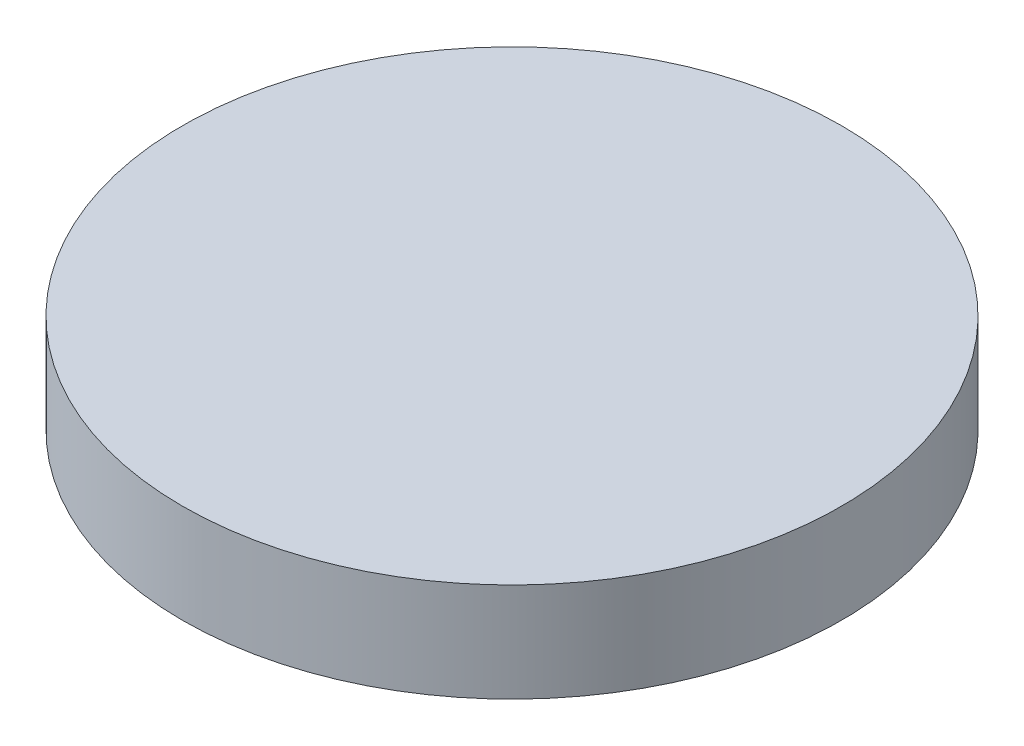
ISO-10303-21;
HEADER;
FILE_DESCRIPTION(('STEP AP214'),'2;1');
FILE_NAME('part.step','',(''),(''),'','','');
FILE_SCHEMA(('AUTOMOTIVE_DESIGN { 1 0 10303 214 1 1 1 1 }'));
ENDSEC;
DATA;
#1=APPLICATION_CONTEXT('core data for automotive mechanical design processes');
#2=APPLICATION_PROTOCOL_DEFINITION('international standard','automotive_design',2000,#1);
#3=PRODUCT_CONTEXT('',#1,'mechanical');
#4=PRODUCT('Part','Part','',(#3));
#5=PRODUCT_RELATED_PRODUCT_CATEGORY('part','',(#4));
#6=PRODUCT_DEFINITION_FORMATION('','',#4);
#7=PRODUCT_DEFINITION_CONTEXT('part definition',#1,'design');
#8=PRODUCT_DEFINITION('design','',#6,#7);
#9=PRODUCT_DEFINITION_SHAPE('','',#8);
#10=(LENGTH_UNIT() NAMED_UNIT(*) SI_UNIT(.MILLI.,.METRE.));
#11=(NAMED_UNIT(*) PLANE_ANGLE_UNIT() SI_UNIT($,.RADIAN.));
#12=(NAMED_UNIT(*) SI_UNIT($,.STERADIAN.) SOLID_ANGLE_UNIT());
#13=UNCERTAINTY_MEASURE_WITH_UNIT(LENGTH_MEASURE(1.E-05),#10,'distance_accuracy_value','');
#14=(GEOMETRIC_REPRESENTATION_CONTEXT(3) GLOBAL_UNCERTAINTY_ASSIGNED_CONTEXT((#13)) GLOBAL_UNIT_ASSIGNED_CONTEXT((#10,
#11,#12)) REPRESENTATION_CONTEXT('',''));
#15=CARTESIAN_POINT('',(0.,0.,0.));
#16=DIRECTION('',(0.,0.,1.));
#17=DIRECTION('',(1.,0.,0.));
#18=AXIS2_PLACEMENT_3D('',#15,#16,#17);
#19=CARTESIAN_POINT('',(0.,38.1,0.));
#20=DIRECTION('',(0.,-1.,0.));
#21=DIRECTION('',(0.,0.,-1.));
#22=AXIS2_PLACEMENT_3D('',#19,#20,#21);
#23=CYLINDRICAL_SURFACE('',#22,127.);
#24=CARTESIAN_POINT('',(0.,38.1,0.));
#25=DIRECTION('',(0.,1.,0.));
#26=DIRECTION('',(0.,0.,1.));
#27=AXIS2_PLACEMENT_3D('',#24,#25,#26);
#28=CIRCLE('',#27,127.);
#29=CARTESIAN_POINT('',(0.,38.1,127.));
#30=VERTEX_POINT('',#29);
#31=EDGE_CURVE('E10',#30,#30,#28,.T.);
#32=ORIENTED_EDGE('',*,*,#31,.F.);
#33=EDGE_LOOP('',(#32));
#34=FACE_BOUND('',#33,.T.);
#35=CARTESIAN_POINT('',(0.,0.,0.));
#36=DIRECTION('',(0.,1.,0.));
#37=DIRECTION('',(0.,0.,1.));
#38=AXIS2_PLACEMENT_3D('',#35,#36,#37);
#39=CIRCLE('',#38,127.);
#40=CARTESIAN_POINT('',(0.,0.,127.));
#41=VERTEX_POINT('',#40);
#42=EDGE_CURVE('E36',#41,#41,#39,.T.);
#43=ORIENTED_EDGE('',*,*,#42,.T.);
#44=EDGE_LOOP('',(#43));
#45=FACE_BOUND('',#44,.T.);
#46=ADVANCED_FACE('F33',(#34,#45),#23,.T.);
#47=CARTESIAN_POINT('',(0.,38.1,0.));
#48=DIRECTION('',(0.,1.,0.));
#49=DIRECTION('',(0.,0.,1.));
#50=AXIS2_PLACEMENT_3D('',#47,#48,#49);
#51=PLANE('',#50);
#52=ORIENTED_EDGE('',*,*,#31,.T.);
#53=EDGE_LOOP('',(#52));
#54=FACE_BOUND('',#53,.T.);
#55=ADVANCED_FACE('F48',(#54),#51,.T.);
#56=CARTESIAN_POINT('',(0.,0.,0.));
#57=DIRECTION('',(0.,1.,0.));
#58=DIRECTION('',(0.,0.,1.));
#59=AXIS2_PLACEMENT_3D('',#56,#57,#58);
#60=PLANE('',#59);
#61=ORIENTED_EDGE('',*,*,#42,.F.);
#62=EDGE_LOOP('',(#61));
#63=FACE_BOUND('',#62,.T.);
#64=ADVANCED_FACE('F46',(#63),#60,.F.);
#65=CLOSED_SHELL('',(#46,#55,#64));
#66=MANIFOLD_SOLID_BREP('B2',#65);
#67=ADVANCED_BREP_SHAPE_REPRESENTATION('',(#18,#66),#14);
#68=SHAPE_DEFINITION_REPRESENTATION(#9,#67);
ENDSEC;
END-ISO-10303-21;
